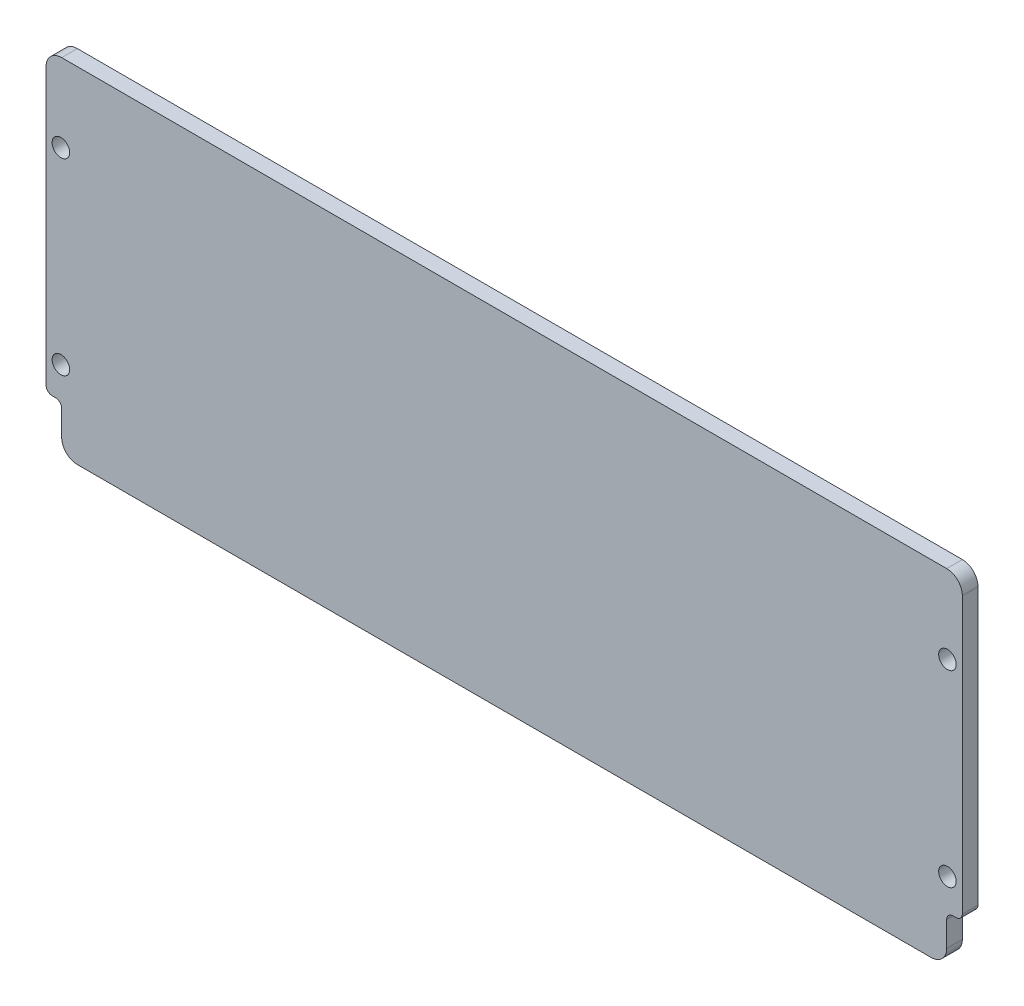
ISO-10303-21;
HEADER;
FILE_DESCRIPTION(('STEP AP214'),'2;1');
FILE_NAME('part.step','',(''),(''),'','','');
FILE_SCHEMA(('AUTOMOTIVE_DESIGN { 1 0 10303 214 1 1 1 1 }'));
ENDSEC;
DATA;
#1=APPLICATION_CONTEXT('core data for automotive mechanical design processes');
#2=APPLICATION_PROTOCOL_DEFINITION('international standard','automotive_design',2000,#1);
#3=PRODUCT_CONTEXT('',#1,'mechanical');
#4=PRODUCT('Part','Part','',(#3));
#5=PRODUCT_RELATED_PRODUCT_CATEGORY('part','',(#4));
#6=PRODUCT_DEFINITION_FORMATION('','',#4);
#7=PRODUCT_DEFINITION_CONTEXT('part definition',#1,'design');
#8=PRODUCT_DEFINITION('design','',#6,#7);
#9=PRODUCT_DEFINITION_SHAPE('','',#8);
#10=(LENGTH_UNIT() NAMED_UNIT(*) SI_UNIT(.MILLI.,.METRE.));
#11=(NAMED_UNIT(*) PLANE_ANGLE_UNIT() SI_UNIT($,.RADIAN.));
#12=(NAMED_UNIT(*) SI_UNIT($,.STERADIAN.) SOLID_ANGLE_UNIT());
#13=UNCERTAINTY_MEASURE_WITH_UNIT(LENGTH_MEASURE(1.E-05),#10,'distance_accuracy_value','');
#14=(GEOMETRIC_REPRESENTATION_CONTEXT(3) GLOBAL_UNCERTAINTY_ASSIGNED_CONTEXT((#13)) GLOBAL_UNIT_ASSIGNED_CONTEXT((#10,
#11,#12)) REPRESENTATION_CONTEXT('',''));
#15=CARTESIAN_POINT('',(0.,0.,0.));
#16=DIRECTION('',(0.,0.,1.));
#17=DIRECTION('',(1.,0.,0.));
#18=AXIS2_PLACEMENT_3D('',#15,#16,#17);
#19=CARTESIAN_POINT('',(183.1975,21.59,6.35));
#20=DIRECTION('',(0.,0.,1.));
#21=DIRECTION('',(1.,0.,0.));
#22=AXIS2_PLACEMENT_3D('',#19,#20,#21);
#23=PLANE('',#22);
#24=CARTESIAN_POINT('',(179.705,107.95,6.35));
#25=DIRECTION('',(0.,0.,1.));
#26=DIRECTION('',(-1.,0.,0.));
#27=AXIS2_PLACEMENT_3D('',#24,#25,#26);
#28=CIRCLE('',#27,3.55600000000001);
#29=CARTESIAN_POINT('',(176.149,107.95,6.35));
#30=VERTEX_POINT('',#29);
#31=EDGE_CURVE('E402',#30,#30,#28,.T.);
#32=ORIENTED_EDGE('',*,*,#31,.F.);
#33=EDGE_LOOP('',(#32));
#34=FACE_BOUND('',#33,.T.);
#35=CARTESIAN_POINT('',(-179.705,31.75,6.35));
#36=DIRECTION('',(0.,0.,1.));
#37=DIRECTION('',(1.,0.,0.));
#38=AXIS2_PLACEMENT_3D('',#35,#36,#37);
#39=CIRCLE('',#38,3.55600000000001);
#40=CARTESIAN_POINT('',(-176.149,31.75,6.35));
#41=VERTEX_POINT('',#40);
#42=EDGE_CURVE('E200',#41,#41,#39,.T.);
#43=ORIENTED_EDGE('',*,*,#42,.F.);
#44=EDGE_LOOP('',(#43));
#45=FACE_BOUND('',#44,.T.);
#46=CARTESIAN_POINT('',(183.1975,21.59,6.35));
#47=DIRECTION('',(0.,0.,1.));
#48=DIRECTION('',(1.,0.,0.));
#49=AXIS2_PLACEMENT_3D('',#46,#47,#48);
#50=CIRCLE('',#49,2.54000000000007);
#51=CARTESIAN_POINT('',(183.1975,19.05,6.35));
#52=VERTEX_POINT('',#51);
#53=CARTESIAN_POINT('',(185.7375,21.59,6.35));
#54=VERTEX_POINT('',#53);
#55=EDGE_CURVE('E242',#52,#54,#50,.T.);
#56=ORIENTED_EDGE('',*,*,#55,.T.);
#57=DIRECTION('',(0.,1.,0.));
#58=VECTOR('',#57,1.);
#59=CARTESIAN_POINT('',(185.7375,133.35,6.35));
#60=LINE('',#59,#58);
#61=CARTESIAN_POINT('',(185.7375,133.35,6.35));
#62=VERTEX_POINT('',#61);
#63=EDGE_CURVE('E130',#54,#62,#60,.T.);
#64=ORIENTED_EDGE('',*,*,#63,.T.);
#65=CARTESIAN_POINT('',(179.3875,133.35,6.35));
#66=DIRECTION('',(0.,0.,1.));
#67=DIRECTION('',(1.,0.,0.));
#68=AXIS2_PLACEMENT_3D('',#65,#66,#67);
#69=CIRCLE('',#68,6.34999999999995);
#70=CARTESIAN_POINT('',(179.3875,139.7,6.35));
#71=VERTEX_POINT('',#70);
#72=EDGE_CURVE('E295',#62,#71,#69,.T.);
#73=ORIENTED_EDGE('',*,*,#72,.T.);
#74=DIRECTION('',(-1.,0.,0.));
#75=VECTOR('',#74,1.);
#76=CARTESIAN_POINT('',(-179.3875,139.7,6.35));
#77=LINE('',#76,#75);
#78=CARTESIAN_POINT('',(-179.3875,139.7,6.35));
#79=VERTEX_POINT('',#78);
#80=EDGE_CURVE('E315',#71,#79,#77,.T.);
#81=ORIENTED_EDGE('',*,*,#80,.T.);
#82=CARTESIAN_POINT('',(-179.3875,133.35,6.35));
#83=DIRECTION('',(0.,0.,1.));
#84=DIRECTION('',(-1.,0.,0.));
#85=AXIS2_PLACEMENT_3D('',#82,#83,#84);
#86=CIRCLE('',#85,6.34999999999997);
#87=CARTESIAN_POINT('',(-185.7375,133.35,6.35));
#88=VERTEX_POINT('',#87);
#89=EDGE_CURVE('E311',#79,#88,#86,.T.);
#90=ORIENTED_EDGE('',*,*,#89,.T.);
#91=DIRECTION('',(0.,-1.,0.));
#92=VECTOR('',#91,1.);
#93=CARTESIAN_POINT('',(-185.7375,133.35,6.35));
#94=LINE('',#93,#92);
#95=CARTESIAN_POINT('',(-185.7375,21.59,6.35));
#96=VERTEX_POINT('',#95);
#97=EDGE_CURVE('E314',#88,#96,#94,.T.);
#98=ORIENTED_EDGE('',*,*,#97,.T.);
#99=CARTESIAN_POINT('',(-183.1975,21.59,6.35));
#100=DIRECTION('',(0.,0.,1.));
#101=DIRECTION('',(-1.,0.,0.));
#102=AXIS2_PLACEMENT_3D('',#99,#100,#101);
#103=CIRCLE('',#102,2.54000000000007);
#104=CARTESIAN_POINT('',(-183.1975,19.05,6.35));
#105=VERTEX_POINT('',#104);
#106=EDGE_CURVE('E319',#96,#105,#103,.T.);
#107=ORIENTED_EDGE('',*,*,#106,.T.);
#108=DIRECTION('',(1.,0.,0.));
#109=VECTOR('',#108,1.);
#110=CARTESIAN_POINT('',(-183.1975,19.05,6.35));
#111=LINE('',#110,#109);
#112=CARTESIAN_POINT('',(-181.9275,19.05,6.35));
#113=VERTEX_POINT('',#112);
#114=EDGE_CURVE('E326',#105,#113,#111,.T.);
#115=ORIENTED_EDGE('',*,*,#114,.T.);
#116=CARTESIAN_POINT('',(-181.9275,16.51,6.35));
#117=DIRECTION('',(0.,0.,-1.));
#118=DIRECTION('',(-1.,0.,0.));
#119=AXIS2_PLACEMENT_3D('',#116,#117,#118);
#120=CIRCLE('',#119,2.54000000000004);
#121=CARTESIAN_POINT('',(-179.3875,16.51,6.35));
#122=VERTEX_POINT('',#121);
#123=EDGE_CURVE('E329',#113,#122,#120,.T.);
#124=ORIENTED_EDGE('',*,*,#123,.T.);
#125=DIRECTION('',(0.,-1.,0.));
#126=VECTOR('',#125,1.);
#127=CARTESIAN_POINT('',(-179.3875,16.51,6.35));
#128=LINE('',#127,#126);
#129=CARTESIAN_POINT('',(-179.3875,6.34999999999997,6.35));
#130=VERTEX_POINT('',#129);
#131=EDGE_CURVE('E332',#122,#130,#128,.T.);
#132=ORIENTED_EDGE('',*,*,#131,.T.);
#133=CARTESIAN_POINT('',(-173.0375,6.34999999999997,6.35));
#134=DIRECTION('',(0.,0.,1.));
#135=DIRECTION('',(1.,0.,0.));
#136=AXIS2_PLACEMENT_3D('',#133,#134,#135);
#137=CIRCLE('',#136,6.34999999999995);
#138=CARTESIAN_POINT('',(-173.0375,0.,6.35));
#139=VERTEX_POINT('',#138);
#140=EDGE_CURVE('E335',#130,#139,#137,.T.);
#141=ORIENTED_EDGE('',*,*,#140,.T.);
#142=DIRECTION('',(1.,0.,0.));
#143=VECTOR('',#142,1.);
#144=CARTESIAN_POINT('',(-173.0375,0.,6.35));
#145=LINE('',#144,#143);
#146=CARTESIAN_POINT('',(173.0375,0.,6.35));
#147=VERTEX_POINT('',#146);
#148=EDGE_CURVE('E338',#139,#147,#145,.T.);
#149=ORIENTED_EDGE('',*,*,#148,.T.);
#150=CARTESIAN_POINT('',(173.0375,6.34999999999997,6.35));
#151=DIRECTION('',(0.,0.,1.));
#152=DIRECTION('',(1.,0.,0.));
#153=AXIS2_PLACEMENT_3D('',#150,#151,#152);
#154=CIRCLE('',#153,6.34999999999995);
#155=CARTESIAN_POINT('',(179.3875,6.34999999999997,6.35));
#156=VERTEX_POINT('',#155);
#157=EDGE_CURVE('E173',#147,#156,#154,.T.);
#158=ORIENTED_EDGE('',*,*,#157,.T.);
#159=DIRECTION('',(0.,1.,0.));
#160=VECTOR('',#159,1.);
#161=CARTESIAN_POINT('',(179.3875,16.51,6.35));
#162=LINE('',#161,#160);
#163=CARTESIAN_POINT('',(179.3875,16.51,6.35));
#164=VERTEX_POINT('',#163);
#165=EDGE_CURVE('E167',#156,#164,#162,.T.);
#166=ORIENTED_EDGE('',*,*,#165,.T.);
#167=CARTESIAN_POINT('',(181.9275,16.51,6.35));
#168=DIRECTION('',(0.,0.,-1.));
#169=DIRECTION('',(1.,0.,0.));
#170=AXIS2_PLACEMENT_3D('',#167,#168,#169);
#171=CIRCLE('',#170,2.53999999999998);
#172=CARTESIAN_POINT('',(181.9275,19.05,6.35));
#173=VERTEX_POINT('',#172);
#174=EDGE_CURVE('E171',#164,#173,#171,.T.);
#175=ORIENTED_EDGE('',*,*,#174,.T.);
#176=DIRECTION('',(1.,0.,0.));
#177=VECTOR('',#176,1.);
#178=CARTESIAN_POINT('',(183.1975,19.05,6.35));
#179=LINE('',#178,#177);
#180=EDGE_CURVE('E63',#173,#52,#179,.T.);
#181=ORIENTED_EDGE('',*,*,#180,.T.);
#182=EDGE_LOOP('',(#56,#64,#73,#81,#90,#98,#107,#115,#124,#132,#141,#149,#158,#166,#175,#181));
#183=FACE_BOUND('',#182,.T.);
#184=CARTESIAN_POINT('',(-179.705,107.95,6.35));
#185=DIRECTION('',(0.,0.,1.));
#186=DIRECTION('',(1.,0.,0.));
#187=AXIS2_PLACEMENT_3D('',#184,#185,#186);
#188=CIRCLE('',#187,3.55600000000001);
#189=CARTESIAN_POINT('',(-176.149,107.95,6.35));
#190=VERTEX_POINT('',#189);
#191=EDGE_CURVE('E410',#190,#190,#188,.T.);
#192=ORIENTED_EDGE('',*,*,#191,.F.);
#193=EDGE_LOOP('',(#192));
#194=FACE_BOUND('',#193,.T.);
#195=CARTESIAN_POINT('',(179.705,31.75,6.35));
#196=DIRECTION('',(0.,0.,1.));
#197=DIRECTION('',(-1.,0.,0.));
#198=AXIS2_PLACEMENT_3D('',#195,#196,#197);
#199=CIRCLE('',#198,3.55600000000001);
#200=CARTESIAN_POINT('',(176.149,31.75,6.35));
#201=VERTEX_POINT('',#200);
#202=EDGE_CURVE('E391',#201,#201,#199,.T.);
#203=ORIENTED_EDGE('',*,*,#202,.F.);
#204=EDGE_LOOP('',(#203));
#205=FACE_BOUND('',#204,.T.);
#206=ADVANCED_FACE('F45',(#34,#45,#183,#194,#205),#23,.T.);
#207=CARTESIAN_POINT('',(183.1975,21.59,0.));
#208=DIRECTION('',(0.,0.,1.));
#209=DIRECTION('',(1.,0.,0.));
#210=AXIS2_PLACEMENT_3D('',#207,#208,#209);
#211=PLANE('',#210);
#212=CARTESIAN_POINT('',(183.1975,21.59,0.));
#213=DIRECTION('',(0.,0.,1.));
#214=DIRECTION('',(1.,0.,0.));
#215=AXIS2_PLACEMENT_3D('',#212,#213,#214);
#216=CIRCLE('',#215,2.54000000000007);
#217=CARTESIAN_POINT('',(183.1975,19.05,0.));
#218=VERTEX_POINT('',#217);
#219=CARTESIAN_POINT('',(185.7375,21.59,0.));
#220=VERTEX_POINT('',#219);
#221=EDGE_CURVE('E195',#218,#220,#216,.T.);
#222=ORIENTED_EDGE('',*,*,#221,.F.);
#223=DIRECTION('',(1.,0.,0.));
#224=VECTOR('',#223,1.);
#225=CARTESIAN_POINT('',(183.1975,19.05,0.));
#226=LINE('',#225,#224);
#227=CARTESIAN_POINT('',(181.9275,19.05,0.));
#228=VERTEX_POINT('',#227);
#229=EDGE_CURVE('E122',#228,#218,#226,.T.);
#230=ORIENTED_EDGE('',*,*,#229,.F.);
#231=CARTESIAN_POINT('',(181.9275,16.51,0.));
#232=DIRECTION('',(0.,0.,-1.));
#233=DIRECTION('',(1.,0.,0.));
#234=AXIS2_PLACEMENT_3D('',#231,#232,#233);
#235=CIRCLE('',#234,2.53999999999998);
#236=CARTESIAN_POINT('',(179.3875,16.51,0.));
#237=VERTEX_POINT('',#236);
#238=EDGE_CURVE('E116',#237,#228,#235,.T.);
#239=ORIENTED_EDGE('',*,*,#238,.F.);
#240=DIRECTION('',(0.,1.,0.));
#241=VECTOR('',#240,1.);
#242=CARTESIAN_POINT('',(179.3875,16.51,0.));
#243=LINE('',#242,#241);
#244=CARTESIAN_POINT('',(179.3875,6.34999999999997,0.));
#245=VERTEX_POINT('',#244);
#246=EDGE_CURVE('E182',#245,#237,#243,.T.);
#247=ORIENTED_EDGE('',*,*,#246,.F.);
#248=CARTESIAN_POINT('',(173.0375,6.34999999999997,0.));
#249=DIRECTION('',(0.,0.,1.));
#250=DIRECTION('',(1.,0.,0.));
#251=AXIS2_PLACEMENT_3D('',#248,#249,#250);
#252=CIRCLE('',#251,6.34999999999995);
#253=CARTESIAN_POINT('',(173.0375,0.,0.));
#254=VERTEX_POINT('',#253);
#255=EDGE_CURVE('E233',#254,#245,#252,.T.);
#256=ORIENTED_EDGE('',*,*,#255,.F.);
#257=DIRECTION('',(1.,0.,0.));
#258=VECTOR('',#257,1.);
#259=CARTESIAN_POINT('',(-173.0375,0.,0.));
#260=LINE('',#259,#258);
#261=CARTESIAN_POINT('',(-173.0375,0.,0.));
#262=VERTEX_POINT('',#261);
#263=EDGE_CURVE('E230',#262,#254,#260,.T.);
#264=ORIENTED_EDGE('',*,*,#263,.F.);
#265=CARTESIAN_POINT('',(-173.0375,6.34999999999997,0.));
#266=DIRECTION('',(0.,0.,1.));
#267=DIRECTION('',(1.,0.,0.));
#268=AXIS2_PLACEMENT_3D('',#265,#266,#267);
#269=CIRCLE('',#268,6.34999999999995);
#270=CARTESIAN_POINT('',(-179.3875,6.34999999999997,0.));
#271=VERTEX_POINT('',#270);
#272=EDGE_CURVE('E227',#271,#262,#269,.T.);
#273=ORIENTED_EDGE('',*,*,#272,.F.);
#274=DIRECTION('',(0.,-1.,0.));
#275=VECTOR('',#274,1.);
#276=CARTESIAN_POINT('',(-179.3875,16.51,0.));
#277=LINE('',#276,#275);
#278=CARTESIAN_POINT('',(-179.3875,16.51,0.));
#279=VERTEX_POINT('',#278);
#280=EDGE_CURVE('E224',#279,#271,#277,.T.);
#281=ORIENTED_EDGE('',*,*,#280,.F.);
#282=CARTESIAN_POINT('',(-181.9275,16.51,0.));
#283=DIRECTION('',(0.,0.,-1.));
#284=DIRECTION('',(-1.,0.,0.));
#285=AXIS2_PLACEMENT_3D('',#282,#283,#284);
#286=CIRCLE('',#285,2.54000000000004);
#287=CARTESIAN_POINT('',(-181.9275,19.05,0.));
#288=VERTEX_POINT('',#287);
#289=EDGE_CURVE('E221',#288,#279,#286,.T.);
#290=ORIENTED_EDGE('',*,*,#289,.F.);
#291=DIRECTION('',(1.,0.,0.));
#292=VECTOR('',#291,1.);
#293=CARTESIAN_POINT('',(-183.1975,19.05,0.));
#294=LINE('',#293,#292);
#295=CARTESIAN_POINT('',(-183.1975,19.05,0.));
#296=VERTEX_POINT('',#295);
#297=EDGE_CURVE('E218',#296,#288,#294,.T.);
#298=ORIENTED_EDGE('',*,*,#297,.F.);
#299=CARTESIAN_POINT('',(-183.1975,21.59,0.));
#300=DIRECTION('',(0.,0.,1.));
#301=DIRECTION('',(-1.,0.,0.));
#302=AXIS2_PLACEMENT_3D('',#299,#300,#301);
#303=CIRCLE('',#302,2.54000000000007);
#304=CARTESIAN_POINT('',(-185.7375,21.59,0.));
#305=VERTEX_POINT('',#304);
#306=EDGE_CURVE('E215',#305,#296,#303,.T.);
#307=ORIENTED_EDGE('',*,*,#306,.F.);
#308=DIRECTION('',(0.,-1.,0.));
#309=VECTOR('',#308,1.);
#310=CARTESIAN_POINT('',(-185.7375,133.35,0.));
#311=LINE('',#310,#309);
#312=CARTESIAN_POINT('',(-185.7375,133.35,0.));
#313=VERTEX_POINT('',#312);
#314=EDGE_CURVE('E212',#313,#305,#311,.T.);
#315=ORIENTED_EDGE('',*,*,#314,.F.);
#316=CARTESIAN_POINT('',(-179.3875,133.35,0.));
#317=DIRECTION('',(0.,0.,1.));
#318=DIRECTION('',(-1.,0.,0.));
#319=AXIS2_PLACEMENT_3D('',#316,#317,#318);
#320=CIRCLE('',#319,6.34999999999997);
#321=CARTESIAN_POINT('',(-179.3875,139.7,0.));
#322=VERTEX_POINT('',#321);
#323=EDGE_CURVE('E209',#322,#313,#320,.T.);
#324=ORIENTED_EDGE('',*,*,#323,.F.);
#325=DIRECTION('',(-1.,0.,0.));
#326=VECTOR('',#325,1.);
#327=CARTESIAN_POINT('',(-179.3875,139.7,0.));
#328=LINE('',#327,#326);
#329=CARTESIAN_POINT('',(179.3875,139.7,0.));
#330=VERTEX_POINT('',#329);
#331=EDGE_CURVE('E206',#330,#322,#328,.T.);
#332=ORIENTED_EDGE('',*,*,#331,.F.);
#333=CARTESIAN_POINT('',(179.3875,133.35,0.));
#334=DIRECTION('',(0.,0.,1.));
#335=DIRECTION('',(1.,0.,0.));
#336=AXIS2_PLACEMENT_3D('',#333,#334,#335);
#337=CIRCLE('',#336,6.34999999999995);
#338=CARTESIAN_POINT('',(185.7375,133.35,0.));
#339=VERTEX_POINT('',#338);
#340=EDGE_CURVE('E203',#339,#330,#337,.T.);
#341=ORIENTED_EDGE('',*,*,#340,.F.);
#342=DIRECTION('',(0.,1.,0.));
#343=VECTOR('',#342,1.);
#344=CARTESIAN_POINT('',(185.7375,133.35,0.));
#345=LINE('',#344,#343);
#346=EDGE_CURVE('E199',#220,#339,#345,.T.);
#347=ORIENTED_EDGE('',*,*,#346,.F.);
#348=EDGE_LOOP('',(#222,#230,#239,#247,#256,#264,#273,#281,#290,#298,#307,#315,#324,#332,#341,#347));
#349=FACE_BOUND('',#348,.T.);
#350=CARTESIAN_POINT('',(-179.705,31.75,0.));
#351=DIRECTION('',(0.,0.,1.));
#352=DIRECTION('',(1.,0.,0.));
#353=AXIS2_PLACEMENT_3D('',#350,#351,#352);
#354=CIRCLE('',#353,3.55600000000001);
#355=CARTESIAN_POINT('',(-176.149,31.75,0.));
#356=VERTEX_POINT('',#355);
#357=EDGE_CURVE('E414',#356,#356,#354,.T.);
#358=ORIENTED_EDGE('',*,*,#357,.T.);
#359=EDGE_LOOP('',(#358));
#360=FACE_BOUND('',#359,.T.);
#361=CARTESIAN_POINT('',(-179.705,107.95,0.));
#362=DIRECTION('',(0.,0.,1.));
#363=DIRECTION('',(1.,0.,0.));
#364=AXIS2_PLACEMENT_3D('',#361,#362,#363);
#365=CIRCLE('',#364,3.55600000000001);
#366=CARTESIAN_POINT('',(-176.149,107.95,0.));
#367=VERTEX_POINT('',#366);
#368=EDGE_CURVE('E406',#367,#367,#365,.T.);
#369=ORIENTED_EDGE('',*,*,#368,.T.);
#370=EDGE_LOOP('',(#369));
#371=FACE_BOUND('',#370,.T.);
#372=CARTESIAN_POINT('',(179.705,107.95,0.));
#373=DIRECTION('',(0.,0.,1.));
#374=DIRECTION('',(-1.,0.,0.));
#375=AXIS2_PLACEMENT_3D('',#372,#373,#374);
#376=CIRCLE('',#375,3.55600000000001);
#377=CARTESIAN_POINT('',(176.149,107.95,0.));
#378=VERTEX_POINT('',#377);
#379=EDGE_CURVE('E399',#378,#378,#376,.T.);
#380=ORIENTED_EDGE('',*,*,#379,.T.);
#381=EDGE_LOOP('',(#380));
#382=FACE_BOUND('',#381,.T.);
#383=CARTESIAN_POINT('',(179.705,31.75,0.));
#384=DIRECTION('',(0.,0.,1.));
#385=DIRECTION('',(-1.,0.,0.));
#386=AXIS2_PLACEMENT_3D('',#383,#384,#385);
#387=CIRCLE('',#386,3.55600000000001);
#388=CARTESIAN_POINT('',(176.149,31.75,0.));
#389=VERTEX_POINT('',#388);
#390=EDGE_CURVE('E394',#389,#389,#387,.T.);
#391=ORIENTED_EDGE('',*,*,#390,.T.);
#392=EDGE_LOOP('',(#391));
#393=FACE_BOUND('',#392,.T.);
#394=ADVANCED_FACE('F299',(#349,#360,#371,#382,#393),#211,.F.);
#395=CARTESIAN_POINT('',(183.1975,21.59,6.35));
#396=DIRECTION('',(0.,0.,-1.));
#397=DIRECTION('',(-1.,0.,0.));
#398=AXIS2_PLACEMENT_3D('',#395,#396,#397);
#399=CYLINDRICAL_SURFACE('',#398,2.54000000000007);
#400=ORIENTED_EDGE('',*,*,#221,.T.);
#401=DIRECTION('',(0.,0.,-1.));
#402=VECTOR('',#401,1.);
#403=CARTESIAN_POINT('',(185.7375,21.59,6.35));
#404=LINE('',#403,#402);
#405=EDGE_CURVE('E11',#54,#220,#404,.T.);
#406=ORIENTED_EDGE('',*,*,#405,.F.);
#407=ORIENTED_EDGE('',*,*,#55,.F.);
#408=DIRECTION('',(0.,0.,-1.));
#409=VECTOR('',#408,1.);
#410=CARTESIAN_POINT('',(183.1975,19.05,6.35));
#411=LINE('',#410,#409);
#412=EDGE_CURVE('E191',#52,#218,#411,.T.);
#413=ORIENTED_EDGE('',*,*,#412,.T.);
#414=EDGE_LOOP('',(#400,#406,#407,#413));
#415=FACE_BOUND('',#414,.T.);
#416=ADVANCED_FACE('F47',(#415),#399,.T.);
#417=CARTESIAN_POINT('',(185.7375,133.35,6.35));
#418=DIRECTION('',(-1.,0.,0.));
#419=DIRECTION('',(0.,-1.,0.));
#420=AXIS2_PLACEMENT_3D('',#417,#418,#419);
#421=PLANE('',#420);
#422=ORIENTED_EDGE('',*,*,#346,.T.);
#423=DIRECTION('',(0.,0.,-1.));
#424=VECTOR('',#423,1.);
#425=CARTESIAN_POINT('',(185.7375,133.35,6.35));
#426=LINE('',#425,#424);
#427=EDGE_CURVE('E55',#62,#339,#426,.T.);
#428=ORIENTED_EDGE('',*,*,#427,.F.);
#429=ORIENTED_EDGE('',*,*,#63,.F.);
#430=ORIENTED_EDGE('',*,*,#405,.T.);
#431=EDGE_LOOP('',(#422,#428,#429,#430));
#432=FACE_BOUND('',#431,.T.);
#433=ADVANCED_FACE('F584',(#432),#421,.F.);
#434=CARTESIAN_POINT('',(179.3875,133.35,6.35));
#435=DIRECTION('',(0.,0.,-1.));
#436=DIRECTION('',(-1.,0.,0.));
#437=AXIS2_PLACEMENT_3D('',#434,#435,#436);
#438=CYLINDRICAL_SURFACE('',#437,6.34999999999995);
#439=ORIENTED_EDGE('',*,*,#340,.T.);
#440=DIRECTION('',(0.,0.,-1.));
#441=VECTOR('',#440,1.);
#442=CARTESIAN_POINT('',(179.3875,139.7,6.35));
#443=LINE('',#442,#441);
#444=EDGE_CURVE('E285',#71,#330,#443,.T.);
#445=ORIENTED_EDGE('',*,*,#444,.F.);
#446=ORIENTED_EDGE('',*,*,#72,.F.);
#447=ORIENTED_EDGE('',*,*,#427,.T.);
#448=EDGE_LOOP('',(#439,#445,#446,#447));
#449=FACE_BOUND('',#448,.T.);
#450=ADVANCED_FACE('F293',(#449),#438,.T.);
#451=CARTESIAN_POINT('',(-179.3875,139.7,6.35));
#452=DIRECTION('',(0.,-1.,0.));
#453=DIRECTION('',(1.,0.,0.));
#454=AXIS2_PLACEMENT_3D('',#451,#452,#453);
#455=PLANE('',#454);
#456=ORIENTED_EDGE('',*,*,#331,.T.);
#457=DIRECTION('',(0.,0.,-1.));
#458=VECTOR('',#457,1.);
#459=CARTESIAN_POINT('',(-179.3875,139.7,6.35));
#460=LINE('',#459,#458);
#461=EDGE_CURVE('E281',#79,#322,#460,.T.);
#462=ORIENTED_EDGE('',*,*,#461,.F.);
#463=ORIENTED_EDGE('',*,*,#80,.F.);
#464=ORIENTED_EDGE('',*,*,#444,.T.);
#465=EDGE_LOOP('',(#456,#462,#463,#464));
#466=FACE_BOUND('',#465,.T.);
#467=ADVANCED_FACE('F305',(#466),#455,.F.);
#468=CARTESIAN_POINT('',(-179.3875,133.35,6.35));
#469=DIRECTION('',(0.,0.,-1.));
#470=DIRECTION('',(-1.,0.,0.));
#471=AXIS2_PLACEMENT_3D('',#468,#469,#470);
#472=CYLINDRICAL_SURFACE('',#471,6.34999999999997);
#473=ORIENTED_EDGE('',*,*,#323,.T.);
#474=DIRECTION('',(0.,0.,-1.));
#475=VECTOR('',#474,1.);
#476=CARTESIAN_POINT('',(-185.7375,133.35,6.35));
#477=LINE('',#476,#475);
#478=EDGE_CURVE('E277',#88,#313,#477,.T.);
#479=ORIENTED_EDGE('',*,*,#478,.F.);
#480=ORIENTED_EDGE('',*,*,#89,.F.);
#481=ORIENTED_EDGE('',*,*,#461,.T.);
#482=EDGE_LOOP('',(#473,#479,#480,#481));
#483=FACE_BOUND('',#482,.T.);
#484=ADVANCED_FACE('F309',(#483),#472,.T.);
#485=CARTESIAN_POINT('',(-185.7375,133.35,6.35));
#486=DIRECTION('',(1.,0.,0.));
#487=DIRECTION('',(0.,1.,0.));
#488=AXIS2_PLACEMENT_3D('',#485,#486,#487);
#489=PLANE('',#488);
#490=ORIENTED_EDGE('',*,*,#314,.T.);
#491=DIRECTION('',(0.,0.,-1.));
#492=VECTOR('',#491,1.);
#493=CARTESIAN_POINT('',(-185.7375,21.59,6.35));
#494=LINE('',#493,#492);
#495=EDGE_CURVE('E273',#96,#305,#494,.T.);
#496=ORIENTED_EDGE('',*,*,#495,.F.);
#497=ORIENTED_EDGE('',*,*,#97,.F.);
#498=ORIENTED_EDGE('',*,*,#478,.T.);
#499=EDGE_LOOP('',(#490,#496,#497,#498));
#500=FACE_BOUND('',#499,.T.);
#501=ADVANCED_FACE('F545',(#500),#489,.F.);
#502=CARTESIAN_POINT('',(-183.1975,21.59,6.35));
#503=DIRECTION('',(0.,0.,-1.));
#504=DIRECTION('',(-1.,0.,0.));
#505=AXIS2_PLACEMENT_3D('',#502,#503,#504);
#506=CYLINDRICAL_SURFACE('',#505,2.54000000000007);
#507=ORIENTED_EDGE('',*,*,#306,.T.);
#508=DIRECTION('',(0.,0.,-1.));
#509=VECTOR('',#508,1.);
#510=CARTESIAN_POINT('',(-183.1975,19.05,6.35));
#511=LINE('',#510,#509);
#512=EDGE_CURVE('E269',#105,#296,#511,.T.);
#513=ORIENTED_EDGE('',*,*,#512,.F.);
#514=ORIENTED_EDGE('',*,*,#106,.F.);
#515=ORIENTED_EDGE('',*,*,#495,.T.);
#516=EDGE_LOOP('',(#507,#513,#514,#515));
#517=FACE_BOUND('',#516,.T.);
#518=ADVANCED_FACE('F534',(#517),#506,.T.);
#519=CARTESIAN_POINT('',(-183.1975,19.05,6.35));
#520=DIRECTION('',(0.,1.,0.));
#521=DIRECTION('',(0.,0.,1.));
#522=AXIS2_PLACEMENT_3D('',#519,#520,#521);
#523=PLANE('',#522);
#524=ORIENTED_EDGE('',*,*,#297,.T.);
#525=DIRECTION('',(0.,0.,-1.));
#526=VECTOR('',#525,1.);
#527=CARTESIAN_POINT('',(-181.9275,19.05,6.35));
#528=LINE('',#527,#526);
#529=EDGE_CURVE('E265',#113,#288,#528,.T.);
#530=ORIENTED_EDGE('',*,*,#529,.F.);
#531=ORIENTED_EDGE('',*,*,#114,.F.);
#532=ORIENTED_EDGE('',*,*,#512,.T.);
#533=EDGE_LOOP('',(#524,#530,#531,#532));
#534=FACE_BOUND('',#533,.T.);
#535=ADVANCED_FACE('F523',(#534),#523,.F.);
#536=CARTESIAN_POINT('',(-181.9275,16.51,6.35));
#537=DIRECTION('',(0.,0.,-1.));
#538=DIRECTION('',(-1.,0.,0.));
#539=AXIS2_PLACEMENT_3D('',#536,#537,#538);
#540=CYLINDRICAL_SURFACE('',#539,2.54000000000004);
#541=ORIENTED_EDGE('',*,*,#289,.T.);
#542=DIRECTION('',(0.,0.,-1.));
#543=VECTOR('',#542,1.);
#544=CARTESIAN_POINT('',(-179.3875,16.51,6.35));
#545=LINE('',#544,#543);
#546=EDGE_CURVE('E261',#122,#279,#545,.T.);
#547=ORIENTED_EDGE('',*,*,#546,.F.);
#548=ORIENTED_EDGE('',*,*,#123,.F.);
#549=ORIENTED_EDGE('',*,*,#529,.T.);
#550=EDGE_LOOP('',(#541,#547,#548,#549));
#551=FACE_BOUND('',#550,.T.);
#552=ADVANCED_FACE('F512',(#551),#540,.F.);
#553=CARTESIAN_POINT('',(-179.3875,16.51,6.35));
#554=DIRECTION('',(1.,0.,0.));
#555=DIRECTION('',(0.,1.,0.));
#556=AXIS2_PLACEMENT_3D('',#553,#554,#555);
#557=PLANE('',#556);
#558=ORIENTED_EDGE('',*,*,#280,.T.);
#559=DIRECTION('',(0.,0.,-1.));
#560=VECTOR('',#559,1.);
#561=CARTESIAN_POINT('',(-179.3875,6.34999999999997,6.35));
#562=LINE('',#561,#560);
#563=EDGE_CURVE('E257',#130,#271,#562,.T.);
#564=ORIENTED_EDGE('',*,*,#563,.F.);
#565=ORIENTED_EDGE('',*,*,#131,.F.);
#566=ORIENTED_EDGE('',*,*,#546,.T.);
#567=EDGE_LOOP('',(#558,#564,#565,#566));
#568=FACE_BOUND('',#567,.T.);
#569=ADVANCED_FACE('F501',(#568),#557,.F.);
#570=CARTESIAN_POINT('',(-173.0375,6.34999999999997,6.35));
#571=DIRECTION('',(0.,0.,-1.));
#572=DIRECTION('',(-1.,0.,0.));
#573=AXIS2_PLACEMENT_3D('',#570,#571,#572);
#574=CYLINDRICAL_SURFACE('',#573,6.34999999999995);
#575=ORIENTED_EDGE('',*,*,#272,.T.);
#576=DIRECTION('',(0.,0.,-1.));
#577=VECTOR('',#576,1.);
#578=CARTESIAN_POINT('',(-173.0375,0.,6.35));
#579=LINE('',#578,#577);
#580=EDGE_CURVE('E253',#139,#262,#579,.T.);
#581=ORIENTED_EDGE('',*,*,#580,.F.);
#582=ORIENTED_EDGE('',*,*,#140,.F.);
#583=ORIENTED_EDGE('',*,*,#563,.T.);
#584=EDGE_LOOP('',(#575,#581,#582,#583));
#585=FACE_BOUND('',#584,.T.);
#586=ADVANCED_FACE('F491',(#585),#574,.T.);
#587=CARTESIAN_POINT('',(-173.0375,0.,6.35));
#588=DIRECTION('',(0.,1.,0.));
#589=DIRECTION('',(0.,0.,1.));
#590=AXIS2_PLACEMENT_3D('',#587,#588,#589);
#591=PLANE('',#590);
#592=ORIENTED_EDGE('',*,*,#263,.T.);
#593=DIRECTION('',(0.,0.,-1.));
#594=VECTOR('',#593,1.);
#595=CARTESIAN_POINT('',(173.0375,0.,6.35));
#596=LINE('',#595,#594);
#597=EDGE_CURVE('E249',#147,#254,#596,.T.);
#598=ORIENTED_EDGE('',*,*,#597,.F.);
#599=ORIENTED_EDGE('',*,*,#148,.F.);
#600=ORIENTED_EDGE('',*,*,#580,.T.);
#601=EDGE_LOOP('',(#592,#598,#599,#600));
#602=FACE_BOUND('',#601,.T.);
#603=ADVANCED_FACE('F346',(#602),#591,.F.);
#604=CARTESIAN_POINT('',(173.0375,6.34999999999997,6.35));
#605=DIRECTION('',(0.,0.,-1.));
#606=DIRECTION('',(-1.,0.,0.));
#607=AXIS2_PLACEMENT_3D('',#604,#605,#606);
#608=CYLINDRICAL_SURFACE('',#607,6.34999999999995);
#609=ORIENTED_EDGE('',*,*,#255,.T.);
#610=DIRECTION('',(0.,0.,-1.));
#611=VECTOR('',#610,1.);
#612=CARTESIAN_POINT('',(179.3875,6.34999999999997,6.35));
#613=LINE('',#612,#611);
#614=EDGE_CURVE('E184',#156,#245,#613,.T.);
#615=ORIENTED_EDGE('',*,*,#614,.F.);
#616=ORIENTED_EDGE('',*,*,#157,.F.);
#617=ORIENTED_EDGE('',*,*,#597,.T.);
#618=EDGE_LOOP('',(#609,#615,#616,#617));
#619=FACE_BOUND('',#618,.T.);
#620=ADVANCED_FACE('F350',(#619),#608,.T.);
#621=CARTESIAN_POINT('',(179.3875,16.51,6.35));
#622=DIRECTION('',(-1.,0.,0.));
#623=DIRECTION('',(0.,-1.,0.));
#624=AXIS2_PLACEMENT_3D('',#621,#622,#623);
#625=PLANE('',#624);
#626=ORIENTED_EDGE('',*,*,#246,.T.);
#627=DIRECTION('',(0.,0.,-1.));
#628=VECTOR('',#627,1.);
#629=CARTESIAN_POINT('',(179.3875,16.51,6.35));
#630=LINE('',#629,#628);
#631=EDGE_CURVE('E179',#164,#237,#630,.T.);
#632=ORIENTED_EDGE('',*,*,#631,.F.);
#633=ORIENTED_EDGE('',*,*,#165,.F.);
#634=ORIENTED_EDGE('',*,*,#614,.T.);
#635=EDGE_LOOP('',(#626,#632,#633,#634));
#636=FACE_BOUND('',#635,.T.);
#637=ADVANCED_FACE('F180',(#636),#625,.F.);
#638=CARTESIAN_POINT('',(181.9275,16.51,6.35));
#639=DIRECTION('',(0.,0.,-1.));
#640=DIRECTION('',(-1.,0.,0.));
#641=AXIS2_PLACEMENT_3D('',#638,#639,#640);
#642=CYLINDRICAL_SURFACE('',#641,2.53999999999998);
#643=ORIENTED_EDGE('',*,*,#238,.T.);
#644=DIRECTION('',(0.,0.,-1.));
#645=VECTOR('',#644,1.);
#646=CARTESIAN_POINT('',(181.9275,19.05,6.35));
#647=LINE('',#646,#645);
#648=EDGE_CURVE('E185',#173,#228,#647,.T.);
#649=ORIENTED_EDGE('',*,*,#648,.F.);
#650=ORIENTED_EDGE('',*,*,#174,.F.);
#651=ORIENTED_EDGE('',*,*,#631,.T.);
#652=EDGE_LOOP('',(#643,#649,#650,#651));
#653=FACE_BOUND('',#652,.T.);
#654=ADVANCED_FACE('F187',(#653),#642,.F.);
#655=CARTESIAN_POINT('',(183.1975,19.05,6.35));
#656=DIRECTION('',(0.,1.,0.));
#657=DIRECTION('',(-1.,0.,0.));
#658=AXIS2_PLACEMENT_3D('',#655,#656,#657);
#659=PLANE('',#658);
#660=ORIENTED_EDGE('',*,*,#229,.T.);
#661=ORIENTED_EDGE('',*,*,#412,.F.);
#662=ORIENTED_EDGE('',*,*,#180,.F.);
#663=ORIENTED_EDGE('',*,*,#648,.T.);
#664=EDGE_LOOP('',(#660,#661,#662,#663));
#665=FACE_BOUND('',#664,.T.);
#666=ADVANCED_FACE('F354',(#665),#659,.F.);
#667=CARTESIAN_POINT('',(-179.705,31.75,6.35));
#668=DIRECTION('',(0.,0.,-1.));
#669=DIRECTION('',(-1.,0.,0.));
#670=AXIS2_PLACEMENT_3D('',#667,#668,#669);
#671=CYLINDRICAL_SURFACE('',#670,3.55600000000001);
#672=ORIENTED_EDGE('',*,*,#42,.T.);
#673=EDGE_LOOP('',(#672));
#674=FACE_BOUND('',#673,.T.);
#675=ORIENTED_EDGE('',*,*,#357,.F.);
#676=EDGE_LOOP('',(#675));
#677=FACE_BOUND('',#676,.T.);
#678=ADVANCED_FACE('F356',(#674,#677),#671,.F.);
#679=CARTESIAN_POINT('',(-179.705,107.95,6.35));
#680=DIRECTION('',(0.,0.,-1.));
#681=DIRECTION('',(-1.,0.,0.));
#682=AXIS2_PLACEMENT_3D('',#679,#680,#681);
#683=CYLINDRICAL_SURFACE('',#682,3.55600000000001);
#684=ORIENTED_EDGE('',*,*,#191,.T.);
#685=EDGE_LOOP('',(#684));
#686=FACE_BOUND('',#685,.T.);
#687=ORIENTED_EDGE('',*,*,#368,.F.);
#688=EDGE_LOOP('',(#687));
#689=FACE_BOUND('',#688,.T.);
#690=ADVANCED_FACE('F362',(#686,#689),#683,.F.);
#691=CARTESIAN_POINT('',(179.705,107.95,6.35));
#692=DIRECTION('',(0.,0.,-1.));
#693=DIRECTION('',(-1.,0.,0.));
#694=AXIS2_PLACEMENT_3D('',#691,#692,#693);
#695=CYLINDRICAL_SURFACE('',#694,3.55600000000001);
#696=ORIENTED_EDGE('',*,*,#31,.T.);
#697=EDGE_LOOP('',(#696));
#698=FACE_BOUND('',#697,.T.);
#699=ORIENTED_EDGE('',*,*,#379,.F.);
#700=EDGE_LOOP('',(#699));
#701=FACE_BOUND('',#700,.T.);
#702=ADVANCED_FACE('F378',(#698,#701),#695,.F.);
#703=CARTESIAN_POINT('',(179.705,31.75,6.35));
#704=DIRECTION('',(0.,0.,-1.));
#705=DIRECTION('',(-1.,0.,0.));
#706=AXIS2_PLACEMENT_3D('',#703,#704,#705);
#707=CYLINDRICAL_SURFACE('',#706,3.55600000000001);
#708=ORIENTED_EDGE('',*,*,#202,.T.);
#709=EDGE_LOOP('',(#708));
#710=FACE_BOUND('',#709,.T.);
#711=ORIENTED_EDGE('',*,*,#390,.F.);
#712=EDGE_LOOP('',(#711));
#713=FACE_BOUND('',#712,.T.);
#714=ADVANCED_FACE('F382',(#710,#713),#707,.F.);
#715=CLOSED_SHELL('',(#206,#394,#416,#433,#450,#467,#484,#501,#518,#535,#552,#569,#586,#603,
#620,#637,#654,#666,#678,#690,#702,#714));
#716=MANIFOLD_SOLID_BREP('B2',#715);
#717=ADVANCED_BREP_SHAPE_REPRESENTATION('',(#18,#716),#14);
#718=SHAPE_DEFINITION_REPRESENTATION(#9,#717);
ENDSEC;
END-ISO-10303-21;
